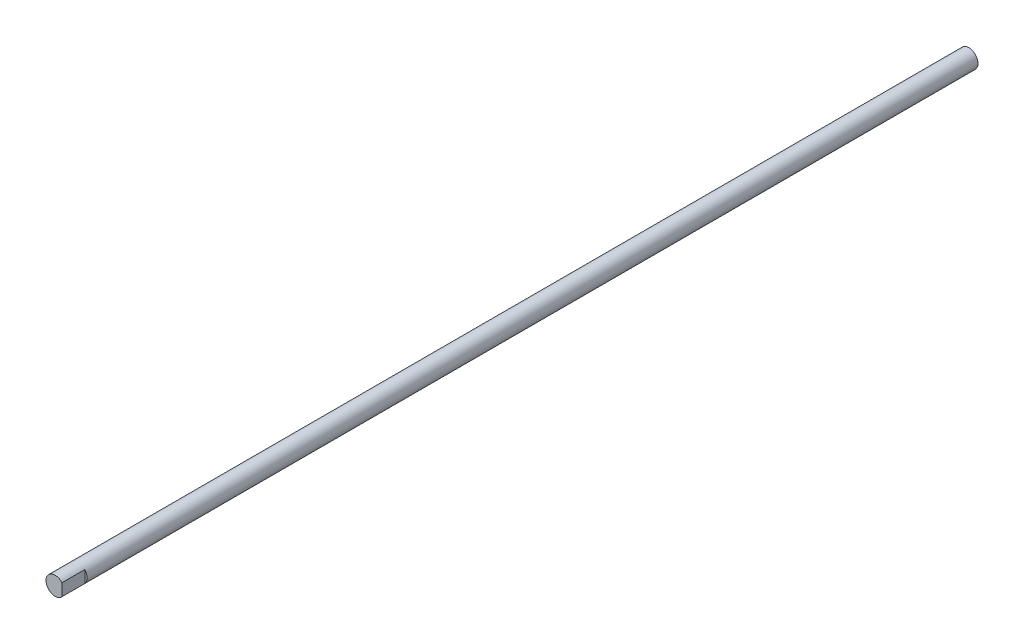
ISO-10303-21;
HEADER;
FILE_DESCRIPTION(('STEP AP214'),'2;1');
FILE_NAME('part.step','',(''),(''),'','','');
FILE_SCHEMA(('AUTOMOTIVE_DESIGN { 1 0 10303 214 1 1 1 1 }'));
ENDSEC;
DATA;
#1=APPLICATION_CONTEXT('core data for automotive mechanical design processes');
#2=APPLICATION_PROTOCOL_DEFINITION('international standard','automotive_design',2000,#1);
#3=PRODUCT_CONTEXT('',#1,'mechanical');
#4=PRODUCT('Part','Part','',(#3));
#5=PRODUCT_RELATED_PRODUCT_CATEGORY('part','',(#4));
#6=PRODUCT_DEFINITION_FORMATION('','',#4);
#7=PRODUCT_DEFINITION_CONTEXT('part definition',#1,'design');
#8=PRODUCT_DEFINITION('design','',#6,#7);
#9=PRODUCT_DEFINITION_SHAPE('','',#8);
#10=(LENGTH_UNIT() NAMED_UNIT(*) SI_UNIT(.MILLI.,.METRE.));
#11=(NAMED_UNIT(*) PLANE_ANGLE_UNIT() SI_UNIT($,.RADIAN.));
#12=(NAMED_UNIT(*) SI_UNIT($,.STERADIAN.) SOLID_ANGLE_UNIT());
#13=UNCERTAINTY_MEASURE_WITH_UNIT(LENGTH_MEASURE(1.E-05),#10,'distance_accuracy_value','');
#14=(GEOMETRIC_REPRESENTATION_CONTEXT(3) GLOBAL_UNCERTAINTY_ASSIGNED_CONTEXT((#13)) GLOBAL_UNIT_ASSIGNED_CONTEXT((#10,
#11,#12)) REPRESENTATION_CONTEXT('',''));
#15=CARTESIAN_POINT('',(0.,0.,0.));
#16=DIRECTION('',(0.,0.,1.));
#17=DIRECTION('',(1.,0.,0.));
#18=AXIS2_PLACEMENT_3D('',#15,#16,#17);
#19=CARTESIAN_POINT('',(0.,0.,400.));
#20=DIRECTION('',(0.,0.,-1.));
#21=DIRECTION('',(-1.,0.,0.));
#22=AXIS2_PLACEMENT_3D('',#19,#20,#21);
#23=CYLINDRICAL_SURFACE('',#22,4.);
#24=CARTESIAN_POINT('',(0.,0.,400.));
#25=DIRECTION('',(0.,0.,1.));
#26=DIRECTION('',(1.,0.,0.));
#27=AXIS2_PLACEMENT_3D('',#24,#25,#26);
#28=CIRCLE('',#27,4.);
#29=CARTESIAN_POINT('',(3.,2.64575131106459,400.));
#30=VERTEX_POINT('',#29);
#31=CARTESIAN_POINT('',(3.,-2.64575131106459,400.));
#32=VERTEX_POINT('',#31);
#33=EDGE_CURVE('E60',#30,#32,#28,.T.);
#34=ORIENTED_EDGE('',*,*,#33,.F.);
#35=DIRECTION('',(0.,0.,-1.));
#36=VECTOR('',#35,1.);
#37=CARTESIAN_POINT('',(3.,2.64575131106459,400.));
#38=LINE('',#37,#36);
#39=CARTESIAN_POINT('',(3.,2.64575131106459,390.));
#40=VERTEX_POINT('',#39);
#41=EDGE_CURVE('E46',#30,#40,#38,.T.);
#42=ORIENTED_EDGE('',*,*,#41,.T.);
#43=CARTESIAN_POINT('',(0.,0.,390.));
#44=DIRECTION('',(0.,0.,1.));
#45=DIRECTION('',(1.,0.,0.));
#46=AXIS2_PLACEMENT_3D('',#43,#44,#45);
#47=CIRCLE('',#46,4.);
#48=CARTESIAN_POINT('',(3.,-2.64575131106459,390.));
#49=VERTEX_POINT('',#48);
#50=EDGE_CURVE('E11',#49,#40,#47,.T.);
#51=ORIENTED_EDGE('',*,*,#50,.F.);
#52=DIRECTION('',(0.,0.,-1.));
#53=VECTOR('',#52,1.);
#54=CARTESIAN_POINT('',(3.,-2.64575131106459,400.));
#55=LINE('',#54,#53);
#56=EDGE_CURVE('E51',#49,#32,#55,.F.);
#57=ORIENTED_EDGE('',*,*,#56,.T.);
#58=EDGE_LOOP('',(#34,#42,#51,#57));
#59=FACE_BOUND('',#58,.T.);
#60=CARTESIAN_POINT('',(0.,0.,0.));
#61=DIRECTION('',(0.,0.,1.));
#62=DIRECTION('',(1.,0.,0.));
#63=AXIS2_PLACEMENT_3D('',#60,#61,#62);
#64=CIRCLE('',#63,4.);
#65=CARTESIAN_POINT('',(4.,0.,0.));
#66=VERTEX_POINT('',#65);
#67=EDGE_CURVE('E67',#66,#66,#64,.T.);
#68=ORIENTED_EDGE('',*,*,#67,.T.);
#69=EDGE_LOOP('',(#68));
#70=FACE_BOUND('',#69,.T.);
#71=ADVANCED_FACE('F32',(#59,#70),#23,.T.);
#72=CARTESIAN_POINT('',(0.,0.,400.));
#73=DIRECTION('',(0.,0.,1.));
#74=DIRECTION('',(1.,0.,0.));
#75=AXIS2_PLACEMENT_3D('',#72,#73,#74);
#76=PLANE('',#75);
#77=DIRECTION('',(0.,-1.,0.));
#78=VECTOR('',#77,1.);
#79=CARTESIAN_POINT('',(3.,0.,400.));
#80=LINE('',#79,#78);
#81=EDGE_CURVE('E39',#30,#32,#80,.T.);
#82=ORIENTED_EDGE('',*,*,#81,.F.);
#83=ORIENTED_EDGE('',*,*,#33,.T.);
#84=EDGE_LOOP('',(#82,#83));
#85=FACE_BOUND('',#84,.T.);
#86=ADVANCED_FACE('F66',(#85),#76,.T.);
#87=CARTESIAN_POINT('',(0.,0.,0.));
#88=DIRECTION('',(0.,0.,1.));
#89=DIRECTION('',(1.,0.,0.));
#90=AXIS2_PLACEMENT_3D('',#87,#88,#89);
#91=PLANE('',#90);
#92=ORIENTED_EDGE('',*,*,#67,.F.);
#93=EDGE_LOOP('',(#92));
#94=FACE_BOUND('',#93,.T.);
#95=ADVANCED_FACE('F76',(#94),#91,.F.);
#96=CARTESIAN_POINT('',(0.,0.,390.));
#97=DIRECTION('',(0.,0.,1.));
#98=DIRECTION('',(1.,0.,0.));
#99=AXIS2_PLACEMENT_3D('',#96,#97,#98);
#100=PLANE('',#99);
#101=ORIENTED_EDGE('',*,*,#50,.T.);
#102=DIRECTION('',(0.,-1.,0.));
#103=VECTOR('',#102,1.);
#104=CARTESIAN_POINT('',(3.,4.,390.));
#105=LINE('',#104,#103);
#106=EDGE_CURVE('E64',#40,#49,#105,.T.);
#107=ORIENTED_EDGE('',*,*,#106,.T.);
#108=EDGE_LOOP('',(#101,#107));
#109=FACE_BOUND('',#108,.T.);
#110=ADVANCED_FACE('F74',(#109),#100,.T.);
#111=CARTESIAN_POINT('',(3.,4.,390.));
#112=DIRECTION('',(-1.,0.,0.));
#113=DIRECTION('',(0.,-1.,0.));
#114=AXIS2_PLACEMENT_3D('',#111,#112,#113);
#115=PLANE('',#114);
#116=ORIENTED_EDGE('',*,*,#81,.T.);
#117=ORIENTED_EDGE('',*,*,#56,.F.);
#118=ORIENTED_EDGE('',*,*,#106,.F.);
#119=ORIENTED_EDGE('',*,*,#41,.F.);
#120=EDGE_LOOP('',(#116,#117,#118,#119));
#121=FACE_BOUND('',#120,.T.);
#122=ADVANCED_FACE('F56',(#121),#115,.F.);
#123=CLOSED_SHELL('',(#71,#86,#95,#110,#122));
#124=MANIFOLD_SOLID_BREP('B2',#123);
#125=ADVANCED_BREP_SHAPE_REPRESENTATION('',(#18,#124),#14);
#126=SHAPE_DEFINITION_REPRESENTATION(#9,#125);
ENDSEC;
END-ISO-10303-21;
